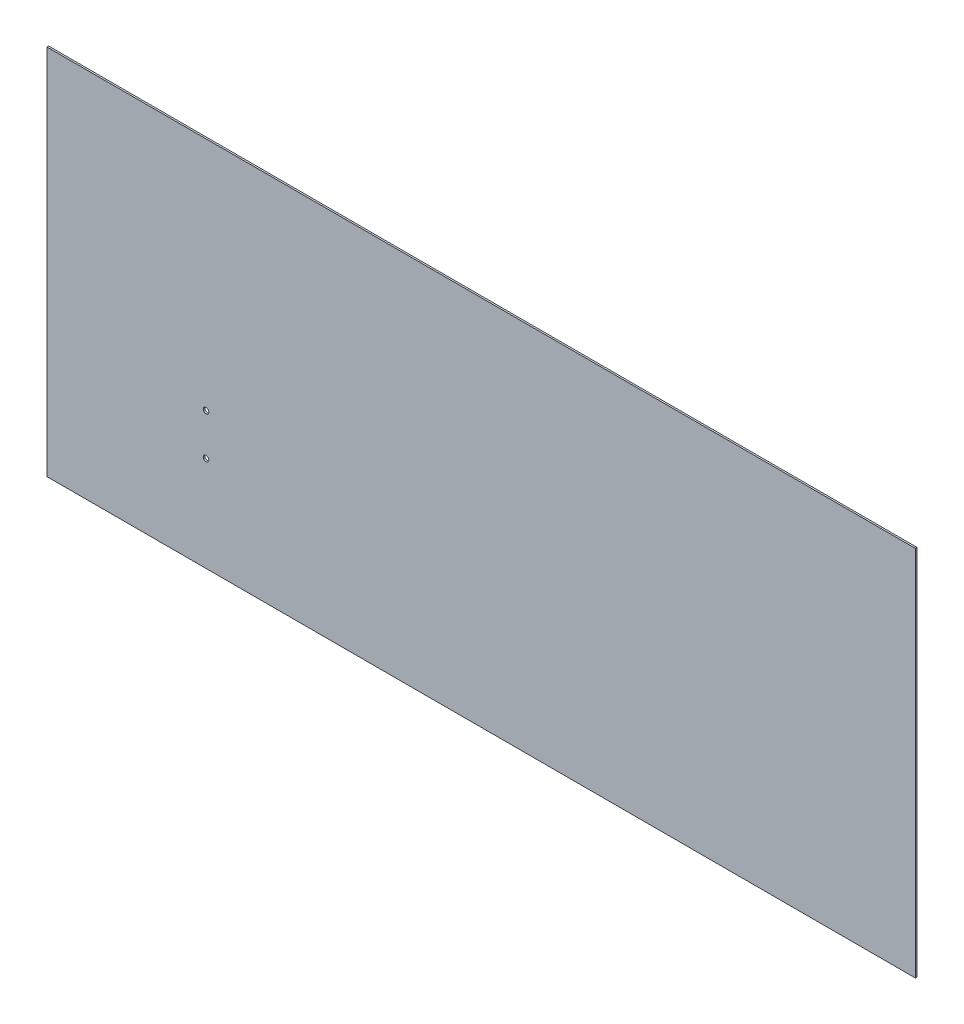
ISO-10303-21;
HEADER;
FILE_DESCRIPTION(('STEP AP214'),'2;1');
FILE_NAME('part.step','',(''),(''),'','','');
FILE_SCHEMA(('AUTOMOTIVE_DESIGN { 1 0 10303 214 1 1 1 1 }'));
ENDSEC;
DATA;
#1=APPLICATION_CONTEXT('core data for automotive mechanical design processes');
#2=APPLICATION_PROTOCOL_DEFINITION('international standard','automotive_design',2000,#1);
#3=PRODUCT_CONTEXT('',#1,'mechanical');
#4=PRODUCT('Part','Part','',(#3));
#5=PRODUCT_RELATED_PRODUCT_CATEGORY('part','',(#4));
#6=PRODUCT_DEFINITION_FORMATION('','',#4);
#7=PRODUCT_DEFINITION_CONTEXT('part definition',#1,'design');
#8=PRODUCT_DEFINITION('design','',#6,#7);
#9=PRODUCT_DEFINITION_SHAPE('','',#8);
#10=(LENGTH_UNIT() NAMED_UNIT(*) SI_UNIT(.MILLI.,.METRE.));
#11=(NAMED_UNIT(*) PLANE_ANGLE_UNIT() SI_UNIT($,.RADIAN.));
#12=(NAMED_UNIT(*) SI_UNIT($,.STERADIAN.) SOLID_ANGLE_UNIT());
#13=UNCERTAINTY_MEASURE_WITH_UNIT(LENGTH_MEASURE(1.E-05),#10,'distance_accuracy_value','');
#14=(GEOMETRIC_REPRESENTATION_CONTEXT(3) GLOBAL_UNCERTAINTY_ASSIGNED_CONTEXT((#13)) GLOBAL_UNIT_ASSIGNED_CONTEXT((#10,
#11,#12)) REPRESENTATION_CONTEXT('',''));
#15=CARTESIAN_POINT('',(0.,0.,0.));
#16=DIRECTION('',(0.,0.,1.));
#17=DIRECTION('',(1.,0.,0.));
#18=AXIS2_PLACEMENT_3D('',#15,#16,#17);
#19=CARTESIAN_POINT('',(400.177,-171.45,-1.5875));
#20=DIRECTION('',(1.,0.,0.));
#21=DIRECTION('',(0.,0.,-1.));
#22=AXIS2_PLACEMENT_3D('',#19,#20,#21);
#23=PLANE('',#22);
#24=DIRECTION('',(0.,1.,0.));
#25=VECTOR('',#24,1.);
#26=CARTESIAN_POINT('',(400.177,-171.45,0.));
#27=LINE('',#26,#25);
#28=CARTESIAN_POINT('',(400.177,-171.45,0.));
#29=VERTEX_POINT('',#28);
#30=CARTESIAN_POINT('',(400.177,171.45,0.));
#31=VERTEX_POINT('',#30);
#32=EDGE_CURVE('E106',#29,#31,#27,.T.);
#33=ORIENTED_EDGE('',*,*,#32,.F.);
#34=DIRECTION('',(0.,0.,1.));
#35=VECTOR('',#34,1.);
#36=CARTESIAN_POINT('',(400.177,-171.45,-1.5875));
#37=LINE('',#36,#35);
#38=CARTESIAN_POINT('',(400.177,-171.45,-1.5875));
#39=VERTEX_POINT('',#38);
#40=EDGE_CURVE('E11',#39,#29,#37,.T.);
#41=ORIENTED_EDGE('',*,*,#40,.F.);
#42=DIRECTION('',(0.,1.,0.));
#43=VECTOR('',#42,1.);
#44=CARTESIAN_POINT('',(400.177,-171.45,-1.5875));
#45=LINE('',#44,#43);
#46=CARTESIAN_POINT('',(400.177,171.45,-1.5875));
#47=VERTEX_POINT('',#46);
#48=EDGE_CURVE('E99',#39,#47,#45,.T.);
#49=ORIENTED_EDGE('',*,*,#48,.T.);
#50=DIRECTION('',(0.,0.,1.));
#51=VECTOR('',#50,1.);
#52=CARTESIAN_POINT('',(400.177,171.45,-1.5875));
#53=LINE('',#52,#51);
#54=EDGE_CURVE('E44',#47,#31,#53,.T.);
#55=ORIENTED_EDGE('',*,*,#54,.T.);
#56=EDGE_LOOP('',(#33,#41,#49,#55));
#57=FACE_BOUND('',#56,.T.);
#58=ADVANCED_FACE('F41',(#57),#23,.T.);
#59=CARTESIAN_POINT('',(-400.177,-171.45,-1.5875));
#60=DIRECTION('',(0.,-1.,0.));
#61=DIRECTION('',(0.,0.,-1.));
#62=AXIS2_PLACEMENT_3D('',#59,#60,#61);
#63=PLANE('',#62);
#64=DIRECTION('',(1.,0.,0.));
#65=VECTOR('',#64,1.);
#66=CARTESIAN_POINT('',(-400.177,-171.45,0.));
#67=LINE('',#66,#65);
#68=CARTESIAN_POINT('',(-400.177,-171.45,0.));
#69=VERTEX_POINT('',#68);
#70=EDGE_CURVE('E101',#69,#29,#67,.T.);
#71=ORIENTED_EDGE('',*,*,#70,.F.);
#72=DIRECTION('',(0.,0.,1.));
#73=VECTOR('',#72,1.);
#74=CARTESIAN_POINT('',(-400.177,-171.45,-1.5875));
#75=LINE('',#74,#73);
#76=CARTESIAN_POINT('',(-400.177,-171.45,-1.5875));
#77=VERTEX_POINT('',#76);
#78=EDGE_CURVE('E50',#77,#69,#75,.T.);
#79=ORIENTED_EDGE('',*,*,#78,.F.);
#80=DIRECTION('',(1.,0.,0.));
#81=VECTOR('',#80,1.);
#82=CARTESIAN_POINT('',(-400.177,-171.45,-1.5875));
#83=LINE('',#82,#81);
#84=EDGE_CURVE('E96',#77,#39,#83,.T.);
#85=ORIENTED_EDGE('',*,*,#84,.T.);
#86=ORIENTED_EDGE('',*,*,#40,.T.);
#87=EDGE_LOOP('',(#71,#79,#85,#86));
#88=FACE_BOUND('',#87,.T.);
#89=ADVANCED_FACE('F117',(#88),#63,.T.);
#90=CARTESIAN_POINT('',(-400.177,-171.45,-1.5875));
#91=DIRECTION('',(-1.,0.,0.));
#92=DIRECTION('',(0.,0.,1.));
#93=AXIS2_PLACEMENT_3D('',#90,#91,#92);
#94=PLANE('',#93);
#95=DIRECTION('',(0.,-1.,0.));
#96=VECTOR('',#95,1.);
#97=CARTESIAN_POINT('',(-400.177,-171.45,0.));
#98=LINE('',#97,#96);
#99=CARTESIAN_POINT('',(-400.177,171.45,0.));
#100=VERTEX_POINT('',#99);
#101=EDGE_CURVE('E91',#100,#69,#98,.T.);
#102=ORIENTED_EDGE('',*,*,#101,.F.);
#103=DIRECTION('',(0.,0.,1.));
#104=VECTOR('',#103,1.);
#105=CARTESIAN_POINT('',(-400.177,171.45,-1.5875));
#106=LINE('',#105,#104);
#107=CARTESIAN_POINT('',(-400.177,171.45,-1.5875));
#108=VERTEX_POINT('',#107);
#109=EDGE_CURVE('E86',#108,#100,#106,.T.);
#110=ORIENTED_EDGE('',*,*,#109,.F.);
#111=DIRECTION('',(0.,-1.,0.));
#112=VECTOR('',#111,1.);
#113=CARTESIAN_POINT('',(-400.177,-171.45,-1.5875));
#114=LINE('',#113,#112);
#115=EDGE_CURVE('E89',#108,#77,#114,.T.);
#116=ORIENTED_EDGE('',*,*,#115,.T.);
#117=ORIENTED_EDGE('',*,*,#78,.T.);
#118=EDGE_LOOP('',(#102,#110,#116,#117));
#119=FACE_BOUND('',#118,.T.);
#120=ADVANCED_FACE('F88',(#119),#94,.T.);
#121=CARTESIAN_POINT('',(-400.177,171.45,-1.5875));
#122=DIRECTION('',(0.,1.,0.));
#123=DIRECTION('',(0.,0.,1.));
#124=AXIS2_PLACEMENT_3D('',#121,#122,#123);
#125=PLANE('',#124);
#126=DIRECTION('',(-1.,0.,0.));
#127=VECTOR('',#126,1.);
#128=CARTESIAN_POINT('',(-400.177,171.45,0.));
#129=LINE('',#128,#127);
#130=EDGE_CURVE('E109',#31,#100,#129,.T.);
#131=ORIENTED_EDGE('',*,*,#130,.F.);
#132=ORIENTED_EDGE('',*,*,#54,.F.);
#133=DIRECTION('',(-1.,0.,0.));
#134=VECTOR('',#133,1.);
#135=CARTESIAN_POINT('',(-400.177,171.45,-1.5875));
#136=LINE('',#135,#134);
#137=EDGE_CURVE('E95',#47,#108,#136,.T.);
#138=ORIENTED_EDGE('',*,*,#137,.T.);
#139=ORIENTED_EDGE('',*,*,#109,.T.);
#140=EDGE_LOOP('',(#131,#132,#138,#139));
#141=FACE_BOUND('',#140,.T.);
#142=ADVANCED_FACE('F98',(#141),#125,.T.);
#143=CARTESIAN_POINT('',(0.,0.,-1.5875));
#144=DIRECTION('',(0.,0.,-1.));
#145=DIRECTION('',(-1.,0.,0.));
#146=AXIS2_PLACEMENT_3D('',#143,#144,#145);
#147=PLANE('',#146);
#148=CARTESIAN_POINT('',(-253.5301,-83.6264856278912,-1.5875));
#149=DIRECTION('',(0.,0.,-1.));
#150=DIRECTION('',(-1.,0.,0.));
#151=AXIS2_PLACEMENT_3D('',#148,#149,#150);
#152=CIRCLE('',#151,2.55269999999996);
#153=CARTESIAN_POINT('',(-256.0828,-83.6264856278912,-1.5875));
#154=VERTEX_POINT('',#153);
#155=EDGE_CURVE('E155',#154,#154,#152,.T.);
#156=ORIENTED_EDGE('',*,*,#155,.F.);
#157=EDGE_LOOP('',(#156));
#158=FACE_BOUND('',#157,.T.);
#159=CARTESIAN_POINT('',(-253.5301,-45.5264856278912,-1.5875));
#160=DIRECTION('',(0.,0.,-1.));
#161=DIRECTION('',(-1.,0.,0.));
#162=AXIS2_PLACEMENT_3D('',#159,#160,#161);
#163=CIRCLE('',#162,2.55269999999996);
#164=CARTESIAN_POINT('',(-256.0828,-45.5264856278912,-1.5875));
#165=VERTEX_POINT('',#164);
#166=EDGE_CURVE('E157',#165,#165,#163,.T.);
#167=ORIENTED_EDGE('',*,*,#166,.F.);
#168=EDGE_LOOP('',(#167));
#169=FACE_BOUND('',#168,.T.);
#170=ORIENTED_EDGE('',*,*,#48,.F.);
#171=ORIENTED_EDGE('',*,*,#84,.F.);
#172=ORIENTED_EDGE('',*,*,#115,.F.);
#173=ORIENTED_EDGE('',*,*,#137,.F.);
#174=EDGE_LOOP('',(#170,#171,#172,#173));
#175=FACE_BOUND('',#174,.T.);
#176=ADVANCED_FACE('F94',(#158,#169,#175),#147,.T.);
#177=CARTESIAN_POINT('',(0.,0.,0.));
#178=DIRECTION('',(0.,0.,-1.));
#179=DIRECTION('',(-1.,0.,0.));
#180=AXIS2_PLACEMENT_3D('',#177,#178,#179);
#181=PLANE('',#180);
#182=CARTESIAN_POINT('',(-253.5301,-83.6264856278912,0.));
#183=DIRECTION('',(0.,0.,-1.));
#184=DIRECTION('',(-1.,0.,0.));
#185=AXIS2_PLACEMENT_3D('',#182,#183,#184);
#186=CIRCLE('',#185,2.55270000000002);
#187=CARTESIAN_POINT('',(-256.0828,-83.6264856278912,0.));
#188=VERTEX_POINT('',#187);
#189=EDGE_CURVE('E153',#188,#188,#186,.T.);
#190=ORIENTED_EDGE('',*,*,#189,.T.);
#191=EDGE_LOOP('',(#190));
#192=FACE_BOUND('',#191,.T.);
#193=CARTESIAN_POINT('',(-253.5301,-45.5264856278912,0.));
#194=DIRECTION('',(0.,0.,-1.));
#195=DIRECTION('',(-1.,0.,0.));
#196=AXIS2_PLACEMENT_3D('',#193,#194,#195);
#197=CIRCLE('',#196,2.55270000000002);
#198=CARTESIAN_POINT('',(-256.0828,-45.5264856278912,0.));
#199=VERTEX_POINT('',#198);
#200=EDGE_CURVE('E110',#199,#199,#197,.T.);
#201=ORIENTED_EDGE('',*,*,#200,.T.);
#202=EDGE_LOOP('',(#201));
#203=FACE_BOUND('',#202,.T.);
#204=ORIENTED_EDGE('',*,*,#32,.T.);
#205=ORIENTED_EDGE('',*,*,#130,.T.);
#206=ORIENTED_EDGE('',*,*,#101,.T.);
#207=ORIENTED_EDGE('',*,*,#70,.T.);
#208=EDGE_LOOP('',(#204,#205,#206,#207));
#209=FACE_BOUND('',#208,.T.);
#210=ADVANCED_FACE('F116',(#192,#203,#209),#181,.F.);
#211=CARTESIAN_POINT('',(-253.5301,-45.5264856278912,-1.5875));
#212=DIRECTION('',(0.,0.,-1.));
#213=DIRECTION('',(-1.,0.,0.));
#214=AXIS2_PLACEMENT_3D('',#211,#212,#213);
#215=CYLINDRICAL_SURFACE('',#214,2.55269999999999);
#216=ORIENTED_EDGE('',*,*,#200,.F.);
#217=EDGE_LOOP('',(#216));
#218=FACE_BOUND('',#217,.T.);
#219=ORIENTED_EDGE('',*,*,#166,.T.);
#220=EDGE_LOOP('',(#219));
#221=FACE_BOUND('',#220,.T.);
#222=ADVANCED_FACE('F137',(#218,#221),#215,.F.);
#223=CARTESIAN_POINT('',(-253.5301,-83.6264856278912,-1.5875));
#224=DIRECTION('',(0.,0.,-1.));
#225=DIRECTION('',(-1.,0.,0.));
#226=AXIS2_PLACEMENT_3D('',#223,#224,#225);
#227=CYLINDRICAL_SURFACE('',#226,2.55269999999999);
#228=ORIENTED_EDGE('',*,*,#189,.F.);
#229=EDGE_LOOP('',(#228));
#230=FACE_BOUND('',#229,.T.);
#231=ORIENTED_EDGE('',*,*,#155,.T.);
#232=EDGE_LOOP('',(#231));
#233=FACE_BOUND('',#232,.T.);
#234=ADVANCED_FACE('F144',(#230,#233),#227,.F.);
#235=CLOSED_SHELL('',(#58,#89,#120,#142,#176,#210,#222,#234));
#236=MANIFOLD_SOLID_BREP('B2',#235);
#237=ADVANCED_BREP_SHAPE_REPRESENTATION('',(#18,#236),#14);
#238=SHAPE_DEFINITION_REPRESENTATION(#9,#237);
ENDSEC;
END-ISO-10303-21;
